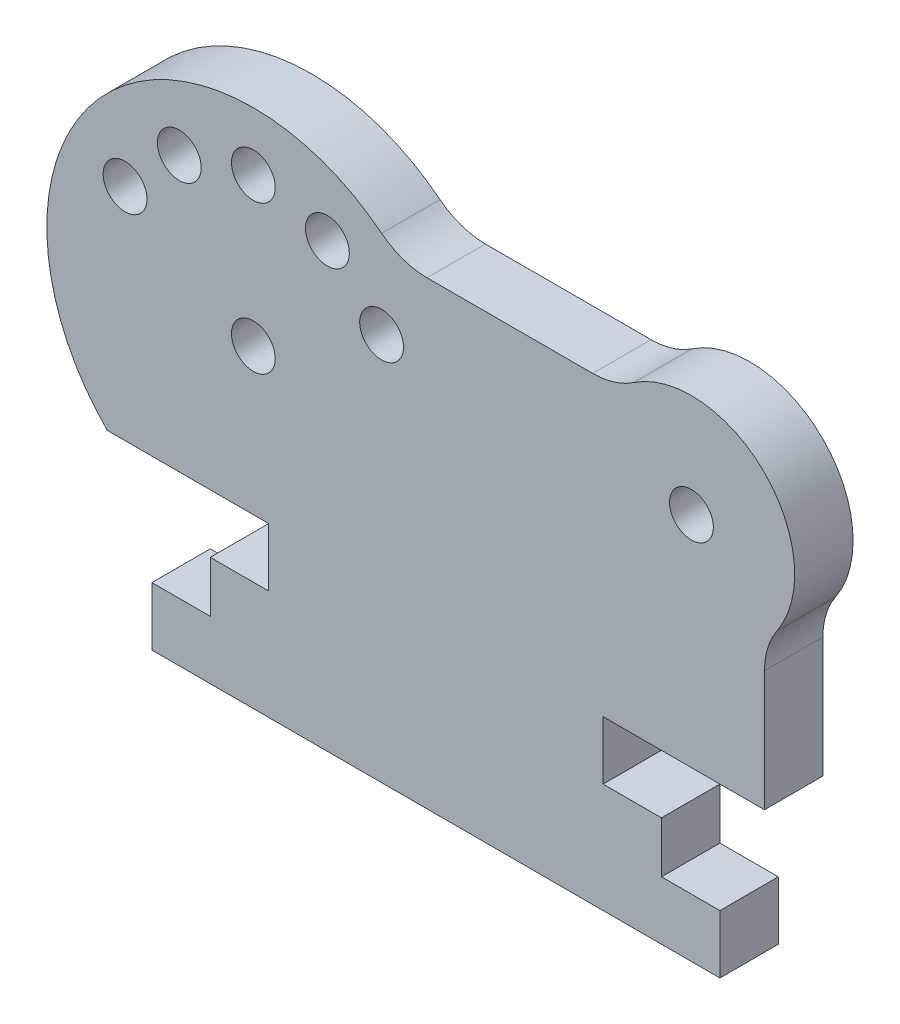
ISO-10303-21;
HEADER;
FILE_DESCRIPTION(('STEP AP214'),'2;1');
FILE_NAME('part.step','',(''),(''),'','','');
FILE_SCHEMA(('AUTOMOTIVE_DESIGN { 1 0 10303 214 1 1 1 1 }'));
ENDSEC;
DATA;
#1=APPLICATION_CONTEXT('core data for automotive mechanical design processes');
#2=APPLICATION_PROTOCOL_DEFINITION('international standard','automotive_design',2000,#1);
#3=PRODUCT_CONTEXT('',#1,'mechanical');
#4=PRODUCT('Part','Part','',(#3));
#5=PRODUCT_RELATED_PRODUCT_CATEGORY('part','',(#4));
#6=PRODUCT_DEFINITION_FORMATION('','',#4);
#7=PRODUCT_DEFINITION_CONTEXT('part definition',#1,'design');
#8=PRODUCT_DEFINITION('design','',#6,#7);
#9=PRODUCT_DEFINITION_SHAPE('','',#8);
#10=(LENGTH_UNIT() NAMED_UNIT(*) SI_UNIT(.MILLI.,.METRE.));
#11=(NAMED_UNIT(*) PLANE_ANGLE_UNIT() SI_UNIT($,.RADIAN.));
#12=(NAMED_UNIT(*) SI_UNIT($,.STERADIAN.) SOLID_ANGLE_UNIT());
#13=UNCERTAINTY_MEASURE_WITH_UNIT(LENGTH_MEASURE(1.E-05),#10,'distance_accuracy_value','');
#14=(GEOMETRIC_REPRESENTATION_CONTEXT(3) GLOBAL_UNCERTAINTY_ASSIGNED_CONTEXT((#13)) GLOBAL_UNIT_ASSIGNED_CONTEXT((#10,
#11,#12)) REPRESENTATION_CONTEXT('',''));
#15=CARTESIAN_POINT('',(0.,0.,0.));
#16=DIRECTION('',(0.,0.,1.));
#17=DIRECTION('',(1.,0.,0.));
#18=AXIS2_PLACEMENT_3D('',#15,#16,#17);
#19=CARTESIAN_POINT('',(36.95,26.5,4.));
#20=DIRECTION('',(0.,0.,-1.));
#21=DIRECTION('',(-1.,0.,0.));
#22=AXIS2_PLACEMENT_3D('',#19,#20,#21);
#23=CYLINDRICAL_SURFACE('',#22,1.5);
#24=CARTESIAN_POINT('',(36.95,26.5,4.));
#25=DIRECTION('',(0.,0.,1.));
#26=DIRECTION('',(1.,0.,0.));
#27=AXIS2_PLACEMENT_3D('',#24,#25,#26);
#28=CIRCLE('',#27,1.5);
#29=CARTESIAN_POINT('',(38.45,26.5,4.));
#30=VERTEX_POINT('',#29);
#31=EDGE_CURVE('E370',#30,#30,#28,.T.);
#32=ORIENTED_EDGE('',*,*,#31,.T.);
#33=EDGE_LOOP('',(#32));
#34=FACE_BOUND('',#33,.T.);
#35=CARTESIAN_POINT('',(36.95,26.5,0.));
#36=DIRECTION('',(0.,0.,1.));
#37=DIRECTION('',(1.,0.,0.));
#38=AXIS2_PLACEMENT_3D('',#35,#36,#37);
#39=CIRCLE('',#38,1.5);
#40=CARTESIAN_POINT('',(38.45,26.5,0.));
#41=VERTEX_POINT('',#40);
#42=EDGE_CURVE('E310',#41,#41,#39,.T.);
#43=ORIENTED_EDGE('',*,*,#42,.F.);
#44=EDGE_LOOP('',(#43));
#45=FACE_BOUND('',#44,.T.);
#46=ADVANCED_FACE('F151',(#34,#45),#23,.F.);
#47=CARTESIAN_POINT('',(1.87893218813431,30.283347098778,4.));
#48=DIRECTION('',(0.,0.,-1.));
#49=DIRECTION('',(-1.,0.,0.));
#50=AXIS2_PLACEMENT_3D('',#47,#48,#49);
#51=CYLINDRICAL_SURFACE('',#50,1.49999999999936);
#52=CARTESIAN_POINT('',(1.87893218813431,30.283347098778,4.));
#53=DIRECTION('',(0.,0.,1.));
#54=DIRECTION('',(1.,0.,0.));
#55=AXIS2_PLACEMENT_3D('',#52,#53,#54);
#56=CIRCLE('',#55,1.49999999999936);
#57=CARTESIAN_POINT('',(3.37893218813367,30.283347098778,4.));
#58=VERTEX_POINT('',#57);
#59=EDGE_CURVE('E367',#58,#58,#56,.T.);
#60=ORIENTED_EDGE('',*,*,#59,.T.);
#61=EDGE_LOOP('',(#60));
#62=FACE_BOUND('',#61,.T.);
#63=CARTESIAN_POINT('',(1.87893218813431,30.283347098778,0.));
#64=DIRECTION('',(0.,0.,1.));
#65=DIRECTION('',(1.,0.,0.));
#66=AXIS2_PLACEMENT_3D('',#63,#64,#65);
#67=CIRCLE('',#66,1.49999999999936);
#68=CARTESIAN_POINT('',(3.37893218813367,30.283347098778,0.));
#69=VERTEX_POINT('',#68);
#70=EDGE_CURVE('E433',#69,#69,#67,.T.);
#71=ORIENTED_EDGE('',*,*,#70,.F.);
#72=EDGE_LOOP('',(#71));
#73=FACE_BOUND('',#72,.T.);
#74=ADVANCED_FACE('F565',(#62,#73),#51,.F.);
#75=CARTESIAN_POINT('',(-1.83334709877815,26.5710678118655,4.));
#76=DIRECTION('',(0.,0.,-1.));
#77=DIRECTION('',(-1.,0.,0.));
#78=AXIS2_PLACEMENT_3D('',#75,#76,#77);
#79=CYLINDRICAL_SURFACE('',#78,1.49999999999932);
#80=CARTESIAN_POINT('',(-1.83334709877815,26.5710678118655,4.));
#81=DIRECTION('',(0.,0.,1.));
#82=DIRECTION('',(1.,0.,0.));
#83=AXIS2_PLACEMENT_3D('',#80,#81,#82);
#84=CIRCLE('',#83,1.49999999999932);
#85=CARTESIAN_POINT('',(-0.333347098778828,26.5710678118655,4.));
#86=VERTEX_POINT('',#85);
#87=EDGE_CURVE('E364',#86,#86,#84,.T.);
#88=ORIENTED_EDGE('',*,*,#87,.T.);
#89=EDGE_LOOP('',(#88));
#90=FACE_BOUND('',#89,.T.);
#91=CARTESIAN_POINT('',(-1.83334709877815,26.5710678118655,0.));
#92=DIRECTION('',(0.,0.,1.));
#93=DIRECTION('',(1.,0.,0.));
#94=AXIS2_PLACEMENT_3D('',#91,#92,#93);
#95=CIRCLE('',#94,1.49999999999932);
#96=CARTESIAN_POINT('',(-0.333347098778828,26.5710678118655,0.));
#97=VERTEX_POINT('',#96);
#98=EDGE_CURVE('E430',#97,#97,#95,.T.);
#99=ORIENTED_EDGE('',*,*,#98,.F.);
#100=EDGE_LOOP('',(#99));
#101=FACE_BOUND('',#100,.T.);
#102=ADVANCED_FACE('F571',(#90,#101),#79,.F.);
#103=CARTESIAN_POINT('',(6.95,31.642135623731,4.));
#104=DIRECTION('',(0.,0.,-1.));
#105=DIRECTION('',(-1.,0.,0.));
#106=AXIS2_PLACEMENT_3D('',#103,#104,#105);
#107=CYLINDRICAL_SURFACE('',#106,1.49999999999945);
#108=CARTESIAN_POINT('',(6.95,31.642135623731,4.));
#109=DIRECTION('',(0.,0.,1.));
#110=DIRECTION('',(1.,0.,0.));
#111=AXIS2_PLACEMENT_3D('',#108,#109,#110);
#112=CIRCLE('',#111,1.49999999999945);
#113=CARTESIAN_POINT('',(8.44999999999945,31.642135623731,4.));
#114=VERTEX_POINT('',#113);
#115=EDGE_CURVE('E361',#114,#114,#112,.T.);
#116=ORIENTED_EDGE('',*,*,#115,.T.);
#117=EDGE_LOOP('',(#116));
#118=FACE_BOUND('',#117,.T.);
#119=CARTESIAN_POINT('',(6.95,31.642135623731,0.));
#120=DIRECTION('',(0.,0.,1.));
#121=DIRECTION('',(1.,0.,0.));
#122=AXIS2_PLACEMENT_3D('',#119,#120,#121);
#123=CIRCLE('',#122,1.49999999999945);
#124=CARTESIAN_POINT('',(8.44999999999945,31.642135623731,0.));
#125=VERTEX_POINT('',#124);
#126=EDGE_CURVE('E427',#125,#125,#123,.T.);
#127=ORIENTED_EDGE('',*,*,#126,.F.);
#128=EDGE_LOOP('',(#127));
#129=FACE_BOUND('',#128,.T.);
#130=ADVANCED_FACE('F580',(#118,#129),#107,.F.);
#131=CARTESIAN_POINT('',(12.0210678118653,30.2833470987779,4.));
#132=DIRECTION('',(0.,0.,-1.));
#133=DIRECTION('',(-1.,0.,0.));
#134=AXIS2_PLACEMENT_3D('',#131,#132,#133);
#135=CYLINDRICAL_SURFACE('',#134,1.5);
#136=CARTESIAN_POINT('',(12.0210678118653,30.2833470987779,4.));
#137=DIRECTION('',(0.,0.,1.));
#138=DIRECTION('',(1.,0.,0.));
#139=AXIS2_PLACEMENT_3D('',#136,#137,#138);
#140=CIRCLE('',#139,1.5);
#141=CARTESIAN_POINT('',(13.5210678118653,30.2833470987779,4.));
#142=VERTEX_POINT('',#141);
#143=EDGE_CURVE('E358',#142,#142,#140,.T.);
#144=ORIENTED_EDGE('',*,*,#143,.T.);
#145=EDGE_LOOP('',(#144));
#146=FACE_BOUND('',#145,.T.);
#147=CARTESIAN_POINT('',(12.0210678118653,30.2833470987779,0.));
#148=DIRECTION('',(0.,0.,1.));
#149=DIRECTION('',(1.,0.,0.));
#150=AXIS2_PLACEMENT_3D('',#147,#148,#149);
#151=CIRCLE('',#150,1.5);
#152=CARTESIAN_POINT('',(13.5210678118653,30.2833470987779,0.));
#153=VERTEX_POINT('',#152);
#154=EDGE_CURVE('E424',#153,#153,#151,.T.);
#155=ORIENTED_EDGE('',*,*,#154,.F.);
#156=EDGE_LOOP('',(#155));
#157=FACE_BOUND('',#156,.T.);
#158=ADVANCED_FACE('F584',(#146,#157),#135,.F.);
#159=CARTESIAN_POINT('',(15.7333470987782,26.5710678118655,4.));
#160=DIRECTION('',(0.,0.,-1.));
#161=DIRECTION('',(-1.,0.,0.));
#162=AXIS2_PLACEMENT_3D('',#159,#160,#161);
#163=CYLINDRICAL_SURFACE('',#162,1.5);
#164=CARTESIAN_POINT('',(15.7333470987782,26.5710678118655,4.));
#165=DIRECTION('',(0.,0.,1.));
#166=DIRECTION('',(1.,0.,0.));
#167=AXIS2_PLACEMENT_3D('',#164,#165,#166);
#168=CIRCLE('',#167,1.5);
#169=CARTESIAN_POINT('',(17.2333470987782,26.5710678118655,4.));
#170=VERTEX_POINT('',#169);
#171=EDGE_CURVE('E355',#170,#170,#168,.T.);
#172=ORIENTED_EDGE('',*,*,#171,.T.);
#173=EDGE_LOOP('',(#172));
#174=FACE_BOUND('',#173,.T.);
#175=CARTESIAN_POINT('',(15.7333470987782,26.5710678118655,0.));
#176=DIRECTION('',(0.,0.,1.));
#177=DIRECTION('',(1.,0.,0.));
#178=AXIS2_PLACEMENT_3D('',#175,#176,#177);
#179=CIRCLE('',#178,1.5);
#180=CARTESIAN_POINT('',(17.2333470987782,26.5710678118655,0.));
#181=VERTEX_POINT('',#180);
#182=EDGE_CURVE('E421',#181,#181,#179,.T.);
#183=ORIENTED_EDGE('',*,*,#182,.F.);
#184=EDGE_LOOP('',(#183));
#185=FACE_BOUND('',#184,.T.);
#186=ADVANCED_FACE('F588',(#174,#185),#163,.F.);
#187=CARTESIAN_POINT('',(4.,0.,4.));
#188=DIRECTION('',(-1.,0.,0.));
#189=DIRECTION('',(0.,0.,1.));
#190=AXIS2_PLACEMENT_3D('',#187,#188,#189);
#191=PLANE('',#190);
#192=DIRECTION('',(0.,1.,0.));
#193=VECTOR('',#192,1.);
#194=CARTESIAN_POINT('',(4.,0.,0.));
#195=LINE('',#194,#193);
#196=CARTESIAN_POINT('',(4.,4.,0.));
#197=VERTEX_POINT('',#196);
#198=CARTESIAN_POINT('',(4.,7.5,0.));
#199=VERTEX_POINT('',#198);
#200=EDGE_CURVE('E375',#197,#199,#195,.T.);
#201=ORIENTED_EDGE('',*,*,#200,.F.);
#202=DIRECTION('',(0.,0.,-1.));
#203=VECTOR('',#202,1.);
#204=CARTESIAN_POINT('',(4.,4.,4.));
#205=LINE('',#204,#203);
#206=CARTESIAN_POINT('',(4.,4.,4.));
#207=VERTEX_POINT('',#206);
#208=EDGE_CURVE('E299',#207,#197,#205,.T.);
#209=ORIENTED_EDGE('',*,*,#208,.F.);
#210=DIRECTION('',(0.,1.,0.));
#211=VECTOR('',#210,1.);
#212=CARTESIAN_POINT('',(4.,0.,4.));
#213=LINE('',#212,#211);
#214=CARTESIAN_POINT('',(4.,7.5,4.));
#215=VERTEX_POINT('',#214);
#216=EDGE_CURVE('E305',#207,#215,#213,.T.);
#217=ORIENTED_EDGE('',*,*,#216,.T.);
#218=DIRECTION('',(0.,0.,-1.));
#219=VECTOR('',#218,1.);
#220=CARTESIAN_POINT('',(4.,7.5,4.));
#221=LINE('',#220,#219);
#222=EDGE_CURVE('E287',#215,#199,#221,.T.);
#223=ORIENTED_EDGE('',*,*,#222,.T.);
#224=EDGE_LOOP('',(#201,#209,#217,#223));
#225=FACE_BOUND('',#224,.T.);
#226=ADVANCED_FACE('F312',(#225),#191,.T.);
#227=CARTESIAN_POINT('',(0.,4.,4.));
#228=DIRECTION('',(0.,1.,0.));
#229=DIRECTION('',(0.,0.,1.));
#230=AXIS2_PLACEMENT_3D('',#227,#228,#229);
#231=PLANE('',#230);
#232=DIRECTION('',(1.,0.,0.));
#233=VECTOR('',#232,1.);
#234=CARTESIAN_POINT('',(0.,4.,0.));
#235=LINE('',#234,#233);
#236=CARTESIAN_POINT('',(0.,4.,0.));
#237=VERTEX_POINT('',#236);
#238=EDGE_CURVE('E378',#237,#197,#235,.T.);
#239=ORIENTED_EDGE('',*,*,#238,.F.);
#240=DIRECTION('',(0.,0.,-1.));
#241=VECTOR('',#240,1.);
#242=CARTESIAN_POINT('',(0.,4.,4.));
#243=LINE('',#242,#241);
#244=CARTESIAN_POINT('',(0.,4.,4.));
#245=VERTEX_POINT('',#244);
#246=EDGE_CURVE('E461',#245,#237,#243,.T.);
#247=ORIENTED_EDGE('',*,*,#246,.F.);
#248=DIRECTION('',(1.,0.,0.));
#249=VECTOR('',#248,1.);
#250=CARTESIAN_POINT('',(0.,4.,4.));
#251=LINE('',#250,#249);
#252=EDGE_CURVE('E313',#245,#207,#251,.T.);
#253=ORIENTED_EDGE('',*,*,#252,.T.);
#254=ORIENTED_EDGE('',*,*,#208,.T.);
#255=EDGE_LOOP('',(#239,#247,#253,#254));
#256=FACE_BOUND('',#255,.T.);
#257=ADVANCED_FACE('F508',(#256),#231,.T.);
#258=CARTESIAN_POINT('',(0.,0.,4.));
#259=DIRECTION('',(-1.,0.,0.));
#260=DIRECTION('',(0.,0.,1.));
#261=AXIS2_PLACEMENT_3D('',#258,#259,#260);
#262=PLANE('',#261);
#263=DIRECTION('',(0.,1.,0.));
#264=VECTOR('',#263,1.);
#265=CARTESIAN_POINT('',(0.,0.,0.));
#266=LINE('',#265,#264);
#267=CARTESIAN_POINT('',(0.,0.,0.));
#268=VERTEX_POINT('',#267);
#269=EDGE_CURVE('E381',#268,#237,#266,.T.);
#270=ORIENTED_EDGE('',*,*,#269,.F.);
#271=DIRECTION('',(0.,0.,-1.));
#272=VECTOR('',#271,1.);
#273=CARTESIAN_POINT('',(0.,0.,4.));
#274=LINE('',#273,#272);
#275=CARTESIAN_POINT('',(0.,0.,4.));
#276=VERTEX_POINT('',#275);
#277=EDGE_CURVE('E459',#276,#268,#274,.T.);
#278=ORIENTED_EDGE('',*,*,#277,.F.);
#279=DIRECTION('',(0.,1.,0.));
#280=VECTOR('',#279,1.);
#281=CARTESIAN_POINT('',(0.,0.,4.));
#282=LINE('',#281,#280);
#283=EDGE_CURVE('E315',#276,#245,#282,.T.);
#284=ORIENTED_EDGE('',*,*,#283,.T.);
#285=ORIENTED_EDGE('',*,*,#246,.T.);
#286=EDGE_LOOP('',(#270,#278,#284,#285));
#287=FACE_BOUND('',#286,.T.);
#288=ADVANCED_FACE('F512',(#287),#262,.T.);
#289=CARTESIAN_POINT('',(0.,0.,4.));
#290=DIRECTION('',(0.,-1.,0.));
#291=DIRECTION('',(0.,0.,-1.));
#292=AXIS2_PLACEMENT_3D('',#289,#290,#291);
#293=PLANE('',#292);
#294=DIRECTION('',(-1.,0.,0.));
#295=VECTOR('',#294,1.);
#296=CARTESIAN_POINT('',(0.,0.,0.));
#297=LINE('',#296,#295);
#298=CARTESIAN_POINT('',(38.9,0.,0.));
#299=VERTEX_POINT('',#298);
#300=EDGE_CURVE('E384',#299,#268,#297,.T.);
#301=ORIENTED_EDGE('',*,*,#300,.F.);
#302=DIRECTION('',(0.,0.,-1.));
#303=VECTOR('',#302,1.);
#304=CARTESIAN_POINT('',(38.9,0.,4.));
#305=LINE('',#304,#303);
#306=CARTESIAN_POINT('',(38.9,0.,4.));
#307=VERTEX_POINT('',#306);
#308=EDGE_CURVE('E457',#307,#299,#305,.T.);
#309=ORIENTED_EDGE('',*,*,#308,.F.);
#310=DIRECTION('',(-1.,0.,0.));
#311=VECTOR('',#310,1.);
#312=CARTESIAN_POINT('',(0.,0.,4.));
#313=LINE('',#312,#311);
#314=EDGE_CURVE('E320',#307,#276,#313,.T.);
#315=ORIENTED_EDGE('',*,*,#314,.T.);
#316=ORIENTED_EDGE('',*,*,#277,.T.);
#317=EDGE_LOOP('',(#301,#309,#315,#316));
#318=FACE_BOUND('',#317,.T.);
#319=ADVANCED_FACE('F515',(#318),#293,.T.);
#320=CARTESIAN_POINT('',(38.9,0.,4.));
#321=DIRECTION('',(1.,0.,0.));
#322=DIRECTION('',(0.,0.,-1.));
#323=AXIS2_PLACEMENT_3D('',#320,#321,#322);
#324=PLANE('',#323);
#325=DIRECTION('',(0.,-1.,0.));
#326=VECTOR('',#325,1.);
#327=CARTESIAN_POINT('',(38.9,0.,0.));
#328=LINE('',#327,#326);
#329=CARTESIAN_POINT('',(38.9,4.,0.));
#330=VERTEX_POINT('',#329);
#331=EDGE_CURVE('E387',#330,#299,#328,.T.);
#332=ORIENTED_EDGE('',*,*,#331,.F.);
#333=DIRECTION('',(0.,0.,-1.));
#334=VECTOR('',#333,1.);
#335=CARTESIAN_POINT('',(38.9,4.,4.));
#336=LINE('',#335,#334);
#337=CARTESIAN_POINT('',(38.9,4.,4.));
#338=VERTEX_POINT('',#337);
#339=EDGE_CURVE('E455',#338,#330,#336,.T.);
#340=ORIENTED_EDGE('',*,*,#339,.F.);
#341=DIRECTION('',(0.,-1.,0.));
#342=VECTOR('',#341,1.);
#343=CARTESIAN_POINT('',(38.9,0.,4.));
#344=LINE('',#343,#342);
#345=EDGE_CURVE('E323',#338,#307,#344,.T.);
#346=ORIENTED_EDGE('',*,*,#345,.T.);
#347=ORIENTED_EDGE('',*,*,#308,.T.);
#348=EDGE_LOOP('',(#332,#340,#346,#347));
#349=FACE_BOUND('',#348,.T.);
#350=ADVANCED_FACE('F520',(#349),#324,.T.);
#351=CARTESIAN_POINT('',(0.,4.,4.));
#352=DIRECTION('',(0.,1.,0.));
#353=DIRECTION('',(0.,0.,1.));
#354=AXIS2_PLACEMENT_3D('',#351,#352,#353);
#355=PLANE('',#354);
#356=DIRECTION('',(1.,0.,0.));
#357=VECTOR('',#356,1.);
#358=CARTESIAN_POINT('',(0.,4.,0.));
#359=LINE('',#358,#357);
#360=CARTESIAN_POINT('',(34.9,4.,0.));
#361=VERTEX_POINT('',#360);
#362=EDGE_CURVE('E390',#361,#330,#359,.T.);
#363=ORIENTED_EDGE('',*,*,#362,.F.);
#364=DIRECTION('',(0.,0.,-1.));
#365=VECTOR('',#364,1.);
#366=CARTESIAN_POINT('',(34.9,4.,4.));
#367=LINE('',#366,#365);
#368=CARTESIAN_POINT('',(34.9,4.,4.));
#369=VERTEX_POINT('',#368);
#370=EDGE_CURVE('E453',#369,#361,#367,.T.);
#371=ORIENTED_EDGE('',*,*,#370,.F.);
#372=DIRECTION('',(1.,0.,0.));
#373=VECTOR('',#372,1.);
#374=CARTESIAN_POINT('',(0.,4.,4.));
#375=LINE('',#374,#373);
#376=EDGE_CURVE('E326',#369,#338,#375,.T.);
#377=ORIENTED_EDGE('',*,*,#376,.T.);
#378=ORIENTED_EDGE('',*,*,#339,.T.);
#379=EDGE_LOOP('',(#363,#371,#377,#378));
#380=FACE_BOUND('',#379,.T.);
#381=ADVANCED_FACE('F523',(#380),#355,.T.);
#382=CARTESIAN_POINT('',(34.9,0.,4.));
#383=DIRECTION('',(1.,0.,0.));
#384=DIRECTION('',(0.,0.,-1.));
#385=AXIS2_PLACEMENT_3D('',#382,#383,#384);
#386=PLANE('',#385);
#387=DIRECTION('',(0.,-1.,0.));
#388=VECTOR('',#387,1.);
#389=CARTESIAN_POINT('',(34.9,0.,0.));
#390=LINE('',#389,#388);
#391=CARTESIAN_POINT('',(34.9,7.5,0.));
#392=VERTEX_POINT('',#391);
#393=EDGE_CURVE('E393',#392,#361,#390,.T.);
#394=ORIENTED_EDGE('',*,*,#393,.F.);
#395=DIRECTION('',(0.,0.,-1.));
#396=VECTOR('',#395,1.);
#397=CARTESIAN_POINT('',(34.9,7.5,4.));
#398=LINE('',#397,#396);
#399=CARTESIAN_POINT('',(34.9,7.5,4.));
#400=VERTEX_POINT('',#399);
#401=EDGE_CURVE('E451',#400,#392,#398,.T.);
#402=ORIENTED_EDGE('',*,*,#401,.F.);
#403=DIRECTION('',(0.,-1.,0.));
#404=VECTOR('',#403,1.);
#405=CARTESIAN_POINT('',(34.9,0.,4.));
#406=LINE('',#405,#404);
#407=EDGE_CURVE('E329',#400,#369,#406,.T.);
#408=ORIENTED_EDGE('',*,*,#407,.T.);
#409=ORIENTED_EDGE('',*,*,#370,.T.);
#410=EDGE_LOOP('',(#394,#402,#408,#409));
#411=FACE_BOUND('',#410,.T.);
#412=ADVANCED_FACE('F528',(#411),#386,.T.);
#413=CARTESIAN_POINT('',(0.,7.5,4.));
#414=DIRECTION('',(0.,1.,0.));
#415=DIRECTION('',(0.,0.,1.));
#416=AXIS2_PLACEMENT_3D('',#413,#414,#415);
#417=PLANE('',#416);
#418=DIRECTION('',(1.,0.,0.));
#419=VECTOR('',#418,1.);
#420=CARTESIAN_POINT('',(0.,7.5,0.));
#421=LINE('',#420,#419);
#422=CARTESIAN_POINT('',(30.9,7.5,0.));
#423=VERTEX_POINT('',#422);
#424=EDGE_CURVE('E396',#423,#392,#421,.T.);
#425=ORIENTED_EDGE('',*,*,#424,.F.);
#426=DIRECTION('',(0.,0.,-1.));
#427=VECTOR('',#426,1.);
#428=CARTESIAN_POINT('',(30.9,7.5,4.));
#429=LINE('',#428,#427);
#430=CARTESIAN_POINT('',(30.9,7.5,4.));
#431=VERTEX_POINT('',#430);
#432=EDGE_CURVE('E449',#431,#423,#429,.T.);
#433=ORIENTED_EDGE('',*,*,#432,.F.);
#434=DIRECTION('',(1.,0.,0.));
#435=VECTOR('',#434,1.);
#436=CARTESIAN_POINT('',(0.,7.5,4.));
#437=LINE('',#436,#435);
#438=EDGE_CURVE('E332',#431,#400,#437,.T.);
#439=ORIENTED_EDGE('',*,*,#438,.T.);
#440=ORIENTED_EDGE('',*,*,#401,.T.);
#441=EDGE_LOOP('',(#425,#433,#439,#440));
#442=FACE_BOUND('',#441,.T.);
#443=ADVANCED_FACE('F531',(#442),#417,.T.);
#444=CARTESIAN_POINT('',(30.9,0.,4.));
#445=DIRECTION('',(1.,0.,0.));
#446=DIRECTION('',(0.,0.,-1.));
#447=AXIS2_PLACEMENT_3D('',#444,#445,#446);
#448=PLANE('',#447);
#449=DIRECTION('',(0.,-1.,0.));
#450=VECTOR('',#449,1.);
#451=CARTESIAN_POINT('',(30.9,0.,0.));
#452=LINE('',#451,#450);
#453=CARTESIAN_POINT('',(30.9,11.5,0.));
#454=VERTEX_POINT('',#453);
#455=EDGE_CURVE('E399',#454,#423,#452,.T.);
#456=ORIENTED_EDGE('',*,*,#455,.F.);
#457=DIRECTION('',(0.,0.,-1.));
#458=VECTOR('',#457,1.);
#459=CARTESIAN_POINT('',(30.9,11.5,4.));
#460=LINE('',#459,#458);
#461=CARTESIAN_POINT('',(30.9,11.5,4.));
#462=VERTEX_POINT('',#461);
#463=EDGE_CURVE('E447',#462,#454,#460,.T.);
#464=ORIENTED_EDGE('',*,*,#463,.F.);
#465=DIRECTION('',(0.,-1.,0.));
#466=VECTOR('',#465,1.);
#467=CARTESIAN_POINT('',(30.9,0.,4.));
#468=LINE('',#467,#466);
#469=EDGE_CURVE('E335',#462,#431,#468,.T.);
#470=ORIENTED_EDGE('',*,*,#469,.T.);
#471=ORIENTED_EDGE('',*,*,#432,.T.);
#472=EDGE_LOOP('',(#456,#464,#470,#471));
#473=FACE_BOUND('',#472,.T.);
#474=ADVANCED_FACE('F536',(#473),#448,.T.);
#475=CARTESIAN_POINT('',(0.,11.5,4.));
#476=DIRECTION('',(0.,-1.,0.));
#477=DIRECTION('',(1.,0.,0.));
#478=AXIS2_PLACEMENT_3D('',#475,#476,#477);
#479=PLANE('',#478);
#480=DIRECTION('',(-1.,0.,0.));
#481=VECTOR('',#480,1.);
#482=CARTESIAN_POINT('',(0.,11.5,0.));
#483=LINE('',#482,#481);
#484=CARTESIAN_POINT('',(41.95,11.5,0.));
#485=VERTEX_POINT('',#484);
#486=EDGE_CURVE('E402',#485,#454,#483,.T.);
#487=ORIENTED_EDGE('',*,*,#486,.F.);
#488=DIRECTION('',(0.,0.,-1.));
#489=VECTOR('',#488,1.);
#490=CARTESIAN_POINT('',(41.95,11.5,4.));
#491=LINE('',#490,#489);
#492=CARTESIAN_POINT('',(41.95,11.5,4.));
#493=VERTEX_POINT('',#492);
#494=EDGE_CURVE('E444',#493,#485,#491,.T.);
#495=ORIENTED_EDGE('',*,*,#494,.F.);
#496=DIRECTION('',(-1.,0.,0.));
#497=VECTOR('',#496,1.);
#498=CARTESIAN_POINT('',(0.,11.5,4.));
#499=LINE('',#498,#497);
#500=EDGE_CURVE('E338',#493,#462,#499,.T.);
#501=ORIENTED_EDGE('',*,*,#500,.T.);
#502=ORIENTED_EDGE('',*,*,#463,.T.);
#503=EDGE_LOOP('',(#487,#495,#501,#502));
#504=FACE_BOUND('',#503,.T.);
#505=ADVANCED_FACE('F539',(#504),#479,.T.);
#506=CARTESIAN_POINT('',(41.95,0.,4.));
#507=DIRECTION('',(1.,0.,0.));
#508=DIRECTION('',(0.,1.,0.));
#509=AXIS2_PLACEMENT_3D('',#506,#507,#508);
#510=PLANE('',#509);
#511=DIRECTION('',(0.,-1.,0.));
#512=VECTOR('',#511,1.);
#513=CARTESIAN_POINT('',(41.95,0.,0.));
#514=LINE('',#513,#512);
#515=CARTESIAN_POINT('',(41.95,19.7390327527302,0.));
#516=VERTEX_POINT('',#515);
#517=EDGE_CURVE('E405',#516,#485,#514,.T.);
#518=ORIENTED_EDGE('',*,*,#517,.F.);
#519=DIRECTION('',(0.,0.,-1.));
#520=VECTOR('',#519,1.);
#521=CARTESIAN_POINT('',(41.95,19.7390327527302,4.));
#522=LINE('',#521,#520);
#523=CARTESIAN_POINT('',(41.95,19.7390327527302,4.));
#524=VERTEX_POINT('',#523);
#525=EDGE_CURVE('E473',#516,#524,#522,.F.);
#526=ORIENTED_EDGE('',*,*,#525,.T.);
#527=DIRECTION('',(0.,-1.,0.));
#528=VECTOR('',#527,1.);
#529=CARTESIAN_POINT('',(41.95,0.,4.));
#530=LINE('',#529,#528);
#531=EDGE_CURVE('E341',#524,#493,#530,.T.);
#532=ORIENTED_EDGE('',*,*,#531,.T.);
#533=ORIENTED_EDGE('',*,*,#494,.T.);
#534=EDGE_LOOP('',(#518,#526,#532,#533));
#535=FACE_BOUND('',#534,.T.);
#536=ADVANCED_FACE('F604',(#535),#510,.T.);
#537=CARTESIAN_POINT('',(36.95,26.5,4.));
#538=DIRECTION('',(0.,0.,-1.));
#539=DIRECTION('',(-1.,0.,0.));
#540=AXIS2_PLACEMENT_3D('',#537,#538,#539);
#541=CYLINDRICAL_SURFACE('',#540,7.07106781186547);
#542=CARTESIAN_POINT('',(36.95,26.5,4.));
#543=DIRECTION('',(0.,0.,1.));
#544=DIRECTION('',(1.,0.,0.));
#545=AXIS2_PLACEMENT_3D('',#542,#543,#544);
#546=CIRCLE('',#545,7.07106781186547);
#547=CARTESIAN_POINT('',(42.8078643762691,22.5395170813097,4.));
#548=VERTEX_POINT('',#547);
#549=CARTESIAN_POINT('',(32.9895170813097,32.357864376269,4.));
#550=VERTEX_POINT('',#549);
#551=EDGE_CURVE('E343',#548,#550,#546,.T.);
#552=ORIENTED_EDGE('',*,*,#551,.F.);
#553=DIRECTION('',(0.,0.,-1.));
#554=VECTOR('',#553,1.);
#555=CARTESIAN_POINT('',(42.8078643762691,22.5395170813097,4.));
#556=LINE('',#555,#554);
#557=CARTESIAN_POINT('',(42.8078643762691,22.5395170813097,0.));
#558=VERTEX_POINT('',#557);
#559=EDGE_CURVE('E470',#548,#558,#556,.T.);
#560=ORIENTED_EDGE('',*,*,#559,.T.);
#561=CARTESIAN_POINT('',(36.95,26.5,0.));
#562=DIRECTION('',(0.,0.,1.));
#563=DIRECTION('',(1.,0.,0.));
#564=AXIS2_PLACEMENT_3D('',#561,#562,#563);
#565=CIRCLE('',#564,7.07106781186547);
#566=CARTESIAN_POINT('',(32.9895170813097,32.357864376269,0.));
#567=VERTEX_POINT('',#566);
#568=EDGE_CURVE('E407',#558,#567,#565,.T.);
#569=ORIENTED_EDGE('',*,*,#568,.T.);
#570=DIRECTION('',(0.,0.,-1.));
#571=VECTOR('',#570,1.);
#572=CARTESIAN_POINT('',(32.9895170813097,32.357864376269,4.));
#573=LINE('',#572,#571);
#574=EDGE_CURVE('E298',#567,#550,#573,.F.);
#575=ORIENTED_EDGE('',*,*,#574,.T.);
#576=EDGE_LOOP('',(#552,#560,#569,#575));
#577=FACE_BOUND('',#576,.T.);
#578=ADVANCED_FACE('F551',(#577),#541,.T.);
#579=CARTESIAN_POINT('',(0.,31.5,4.));
#580=DIRECTION('',(0.,1.,0.));
#581=DIRECTION('',(0.,0.,1.));
#582=AXIS2_PLACEMENT_3D('',#579,#580,#581);
#583=PLANE('',#582);
#584=DIRECTION('',(1.,0.,0.));
#585=VECTOR('',#584,1.);
#586=CARTESIAN_POINT('',(0.,31.5,4.));
#587=LINE('',#586,#585);
#588=CARTESIAN_POINT('',(18.8420711500272,31.5,4.));
#589=VERTEX_POINT('',#588);
#590=CARTESIAN_POINT('',(30.1890327527302,31.5,4.));
#591=VERTEX_POINT('',#590);
#592=EDGE_CURVE('E346',#589,#591,#587,.T.);
#593=ORIENTED_EDGE('',*,*,#592,.T.);
#594=DIRECTION('',(0.,0.,-1.));
#595=VECTOR('',#594,1.);
#596=CARTESIAN_POINT('',(30.1890327527302,31.5,4.));
#597=LINE('',#596,#595);
#598=CARTESIAN_POINT('',(30.1890327527302,31.5,0.));
#599=VERTEX_POINT('',#598);
#600=EDGE_CURVE('E477',#591,#599,#597,.T.);
#601=ORIENTED_EDGE('',*,*,#600,.T.);
#602=DIRECTION('',(1.,0.,0.));
#603=VECTOR('',#602,1.);
#604=CARTESIAN_POINT('',(0.,31.5,0.));
#605=LINE('',#604,#603);
#606=CARTESIAN_POINT('',(18.8420711500272,31.5,0.));
#607=VERTEX_POINT('',#606);
#608=EDGE_CURVE('E410',#607,#599,#605,.T.);
#609=ORIENTED_EDGE('',*,*,#608,.F.);
#610=DIRECTION('',(0.,0.,-1.));
#611=VECTOR('',#610,1.);
#612=CARTESIAN_POINT('',(18.8420711500272,31.5,4.));
#613=LINE('',#612,#611);
#614=EDGE_CURVE('E475',#607,#589,#613,.F.);
#615=ORIENTED_EDGE('',*,*,#614,.T.);
#616=EDGE_LOOP('',(#593,#601,#609,#615));
#617=FACE_BOUND('',#616,.T.);
#618=ADVANCED_FACE('F495',(#617),#583,.T.);
#619=CARTESIAN_POINT('',(6.95000000000001,21.5,4.));
#620=DIRECTION('',(0.,0.,-1.));
#621=DIRECTION('',(-1.,0.,0.));
#622=AXIS2_PLACEMENT_3D('',#619,#620,#621);
#623=CYLINDRICAL_SURFACE('',#622,14.1421356237309);
#624=CARTESIAN_POINT('',(6.95000000000001,21.5,4.));
#625=DIRECTION('',(0.,0.,1.));
#626=DIRECTION('',(1.,0.,0.));
#627=AXIS2_PLACEMENT_3D('',#624,#625,#626);
#628=CIRCLE('',#627,14.1421356237309);
#629=CARTESIAN_POINT('',(15.7358160842956,32.5819418755439,4.));
#630=VERTEX_POINT('',#629);
#631=CARTESIAN_POINT('',(-3.04999999999999,11.5,4.));
#632=VERTEX_POINT('',#631);
#633=EDGE_CURVE('E349',#630,#632,#628,.T.);
#634=ORIENTED_EDGE('',*,*,#633,.F.);
#635=DIRECTION('',(0.,0.,-1.));
#636=VECTOR('',#635,1.);
#637=CARTESIAN_POINT('',(15.7358160842956,32.5819418755439,4.));
#638=LINE('',#637,#636);
#639=CARTESIAN_POINT('',(15.7358160842956,32.5819418755439,0.));
#640=VERTEX_POINT('',#639);
#641=EDGE_CURVE('E480',#630,#640,#638,.T.);
#642=ORIENTED_EDGE('',*,*,#641,.T.);
#643=CARTESIAN_POINT('',(6.95000000000001,21.5,0.));
#644=DIRECTION('',(0.,0.,1.));
#645=DIRECTION('',(1.,0.,0.));
#646=AXIS2_PLACEMENT_3D('',#643,#644,#645);
#647=CIRCLE('',#646,14.1421356237309);
#648=CARTESIAN_POINT('',(-3.04999999999999,11.5,0.));
#649=VERTEX_POINT('',#648);
#650=EDGE_CURVE('E413',#640,#649,#647,.T.);
#651=ORIENTED_EDGE('',*,*,#650,.T.);
#652=DIRECTION('',(0.,0.,-1.));
#653=VECTOR('',#652,1.);
#654=CARTESIAN_POINT('',(-3.04999999999999,11.5,4.));
#655=LINE('',#654,#653);
#656=EDGE_CURVE('E441',#632,#649,#655,.T.);
#657=ORIENTED_EDGE('',*,*,#656,.F.);
#658=EDGE_LOOP('',(#634,#642,#651,#657));
#659=FACE_BOUND('',#658,.T.);
#660=ADVANCED_FACE('F498',(#659),#623,.T.);
#661=CARTESIAN_POINT('',(0.,11.5,4.));
#662=DIRECTION('',(0.,-1.,0.));
#663=DIRECTION('',(1.,0.,0.));
#664=AXIS2_PLACEMENT_3D('',#661,#662,#663);
#665=PLANE('',#664);
#666=DIRECTION('',(-1.,0.,0.));
#667=VECTOR('',#666,1.);
#668=CARTESIAN_POINT('',(0.,11.5,0.));
#669=LINE('',#668,#667);
#670=CARTESIAN_POINT('',(8.,11.5,0.));
#671=VERTEX_POINT('',#670);
#672=EDGE_CURVE('E415',#671,#649,#669,.T.);
#673=ORIENTED_EDGE('',*,*,#672,.F.);
#674=DIRECTION('',(0.,0.,-1.));
#675=VECTOR('',#674,1.);
#676=CARTESIAN_POINT('',(8.,11.5,4.));
#677=LINE('',#676,#675);
#678=CARTESIAN_POINT('',(8.,11.5,4.));
#679=VERTEX_POINT('',#678);
#680=EDGE_CURVE('E439',#679,#671,#677,.T.);
#681=ORIENTED_EDGE('',*,*,#680,.F.);
#682=DIRECTION('',(-1.,0.,0.));
#683=VECTOR('',#682,1.);
#684=CARTESIAN_POINT('',(0.,11.5,4.));
#685=LINE('',#684,#683);
#686=EDGE_CURVE('E351',#679,#632,#685,.T.);
#687=ORIENTED_EDGE('',*,*,#686,.T.);
#688=ORIENTED_EDGE('',*,*,#656,.T.);
#689=EDGE_LOOP('',(#673,#681,#687,#688));
#690=FACE_BOUND('',#689,.T.);
#691=ADVANCED_FACE('F595',(#690),#665,.T.);
#692=CARTESIAN_POINT('',(8.,0.,4.));
#693=DIRECTION('',(-1.,0.,0.));
#694=DIRECTION('',(0.,0.,1.));
#695=AXIS2_PLACEMENT_3D('',#692,#693,#694);
#696=PLANE('',#695);
#697=DIRECTION('',(0.,1.,0.));
#698=VECTOR('',#697,1.);
#699=CARTESIAN_POINT('',(8.,0.,0.));
#700=LINE('',#699,#698);
#701=CARTESIAN_POINT('',(8.,7.5,0.));
#702=VERTEX_POINT('',#701);
#703=EDGE_CURVE('E418',#702,#671,#700,.T.);
#704=ORIENTED_EDGE('',*,*,#703,.F.);
#705=DIRECTION('',(0.,0.,-1.));
#706=VECTOR('',#705,1.);
#707=CARTESIAN_POINT('',(8.,7.5,4.));
#708=LINE('',#707,#706);
#709=CARTESIAN_POINT('',(8.,7.5,4.));
#710=VERTEX_POINT('',#709);
#711=EDGE_CURVE('E373',#710,#702,#708,.T.);
#712=ORIENTED_EDGE('',*,*,#711,.F.);
#713=DIRECTION('',(0.,1.,0.));
#714=VECTOR('',#713,1.);
#715=CARTESIAN_POINT('',(8.,0.,4.));
#716=LINE('',#715,#714);
#717=EDGE_CURVE('E309',#710,#679,#716,.T.);
#718=ORIENTED_EDGE('',*,*,#717,.T.);
#719=ORIENTED_EDGE('',*,*,#680,.T.);
#720=EDGE_LOOP('',(#704,#712,#718,#719));
#721=FACE_BOUND('',#720,.T.);
#722=ADVANCED_FACE('F503',(#721),#696,.T.);
#723=CARTESIAN_POINT('',(0.,7.5,4.));
#724=DIRECTION('',(0.,1.,0.));
#725=DIRECTION('',(0.,0.,1.));
#726=AXIS2_PLACEMENT_3D('',#723,#724,#725);
#727=PLANE('',#726);
#728=DIRECTION('',(1.,0.,0.));
#729=VECTOR('',#728,1.);
#730=CARTESIAN_POINT('',(0.,7.5,0.));
#731=LINE('',#730,#729);
#732=EDGE_CURVE('E293',#199,#702,#731,.T.);
#733=ORIENTED_EDGE('',*,*,#732,.F.);
#734=ORIENTED_EDGE('',*,*,#222,.F.);
#735=DIRECTION('',(1.,0.,0.));
#736=VECTOR('',#735,1.);
#737=CARTESIAN_POINT('',(0.,7.5,4.));
#738=LINE('',#737,#736);
#739=EDGE_CURVE('E290',#215,#710,#738,.T.);
#740=ORIENTED_EDGE('',*,*,#739,.T.);
#741=ORIENTED_EDGE('',*,*,#711,.T.);
#742=EDGE_LOOP('',(#733,#734,#740,#741));
#743=FACE_BOUND('',#742,.T.);
#744=ADVANCED_FACE('F289',(#743),#727,.T.);
#745=CARTESIAN_POINT('',(0.,0.,0.));
#746=DIRECTION('',(0.,0.,1.));
#747=DIRECTION('',(1.,0.,0.));
#748=AXIS2_PLACEMENT_3D('',#745,#746,#747);
#749=PLANE('',#748);
#750=ORIENTED_EDGE('',*,*,#732,.T.);
#751=ORIENTED_EDGE('',*,*,#703,.T.);
#752=ORIENTED_EDGE('',*,*,#672,.T.);
#753=ORIENTED_EDGE('',*,*,#650,.F.);
#754=CARTESIAN_POINT('',(18.8420711500272,36.5,0.));
#755=DIRECTION('',(0.,0.,1.));
#756=DIRECTION('',(1.,0.,0.));
#757=AXIS2_PLACEMENT_3D('',#754,#755,#756);
#758=CIRCLE('',#757,5.);
#759=EDGE_CURVE('E159',#640,#607,#758,.T.);
#760=ORIENTED_EDGE('',*,*,#759,.T.);
#761=ORIENTED_EDGE('',*,*,#608,.T.);
#762=CARTESIAN_POINT('',(30.1890327527302,36.5,0.));
#763=DIRECTION('',(0.,0.,1.));
#764=DIRECTION('',(1.,0.,0.));
#765=AXIS2_PLACEMENT_3D('',#762,#763,#764);
#766=CIRCLE('',#765,5.);
#767=EDGE_CURVE('E486',#599,#567,#766,.T.);
#768=ORIENTED_EDGE('',*,*,#767,.T.);
#769=ORIENTED_EDGE('',*,*,#568,.F.);
#770=CARTESIAN_POINT('',(46.95,19.7390327527302,0.));
#771=DIRECTION('',(0.,0.,1.));
#772=DIRECTION('',(1.,0.,0.));
#773=AXIS2_PLACEMENT_3D('',#770,#771,#772);
#774=CIRCLE('',#773,5.);
#775=EDGE_CURVE('E482',#558,#516,#774,.T.);
#776=ORIENTED_EDGE('',*,*,#775,.T.);
#777=ORIENTED_EDGE('',*,*,#517,.T.);
#778=ORIENTED_EDGE('',*,*,#486,.T.);
#779=ORIENTED_EDGE('',*,*,#455,.T.);
#780=ORIENTED_EDGE('',*,*,#424,.T.);
#781=ORIENTED_EDGE('',*,*,#393,.T.);
#782=ORIENTED_EDGE('',*,*,#362,.T.);
#783=ORIENTED_EDGE('',*,*,#331,.T.);
#784=ORIENTED_EDGE('',*,*,#300,.T.);
#785=ORIENTED_EDGE('',*,*,#269,.T.);
#786=ORIENTED_EDGE('',*,*,#238,.T.);
#787=ORIENTED_EDGE('',*,*,#200,.T.);
#788=EDGE_LOOP('',(#750,#751,#752,#753,#760,#761,#768,#769,#776,#777,#778,#779,#780,#781,#782,
#783,#784,#785,#786,#787));
#789=FACE_BOUND('',#788,.T.);
#790=ORIENTED_EDGE('',*,*,#182,.T.);
#791=EDGE_LOOP('',(#790));
#792=FACE_BOUND('',#791,.T.);
#793=ORIENTED_EDGE('',*,*,#154,.T.);
#794=EDGE_LOOP('',(#793));
#795=FACE_BOUND('',#794,.T.);
#796=ORIENTED_EDGE('',*,*,#126,.T.);
#797=EDGE_LOOP('',(#796));
#798=FACE_BOUND('',#797,.T.);
#799=ORIENTED_EDGE('',*,*,#98,.T.);
#800=EDGE_LOOP('',(#799));
#801=FACE_BOUND('',#800,.T.);
#802=ORIENTED_EDGE('',*,*,#70,.T.);
#803=EDGE_LOOP('',(#802));
#804=FACE_BOUND('',#803,.T.);
#805=ORIENTED_EDGE('',*,*,#42,.T.);
#806=EDGE_LOOP('',(#805));
#807=FACE_BOUND('',#806,.T.);
#808=CARTESIAN_POINT('',(6.95000000000001,21.5,0.));
#809=DIRECTION('',(0.,0.,1.));
#810=DIRECTION('',(1.,0.,0.));
#811=AXIS2_PLACEMENT_3D('',#808,#809,#810);
#812=CIRCLE('',#811,1.5);
#813=CARTESIAN_POINT('',(8.45000000000001,21.5,0.));
#814=VERTEX_POINT('',#813);
#815=EDGE_CURVE('E466',#814,#814,#812,.T.);
#816=ORIENTED_EDGE('',*,*,#815,.T.);
#817=EDGE_LOOP('',(#816));
#818=FACE_BOUND('',#817,.T.);
#819=ADVANCED_FACE('F492',(#789,#792,#795,#798,#801,#804,#807,#818),#749,.F.);
#820=CARTESIAN_POINT('',(0.,0.,4.));
#821=DIRECTION('',(0.,0.,1.));
#822=DIRECTION('',(1.,0.,0.));
#823=AXIS2_PLACEMENT_3D('',#820,#821,#822);
#824=PLANE('',#823);
#825=ORIENTED_EDGE('',*,*,#739,.F.);
#826=ORIENTED_EDGE('',*,*,#216,.F.);
#827=ORIENTED_EDGE('',*,*,#252,.F.);
#828=ORIENTED_EDGE('',*,*,#283,.F.);
#829=ORIENTED_EDGE('',*,*,#314,.F.);
#830=ORIENTED_EDGE('',*,*,#345,.F.);
#831=ORIENTED_EDGE('',*,*,#376,.F.);
#832=ORIENTED_EDGE('',*,*,#407,.F.);
#833=ORIENTED_EDGE('',*,*,#438,.F.);
#834=ORIENTED_EDGE('',*,*,#469,.F.);
#835=ORIENTED_EDGE('',*,*,#500,.F.);
#836=ORIENTED_EDGE('',*,*,#531,.F.);
#837=CARTESIAN_POINT('',(46.95,19.7390327527302,4.));
#838=DIRECTION('',(0.,0.,1.));
#839=DIRECTION('',(1.,0.,0.));
#840=AXIS2_PLACEMENT_3D('',#837,#838,#839);
#841=CIRCLE('',#840,5.);
#842=EDGE_CURVE('E484',#524,#548,#841,.F.);
#843=ORIENTED_EDGE('',*,*,#842,.T.);
#844=ORIENTED_EDGE('',*,*,#551,.T.);
#845=CARTESIAN_POINT('',(30.1890327527302,36.5,4.));
#846=DIRECTION('',(0.,0.,1.));
#847=DIRECTION('',(1.,0.,0.));
#848=AXIS2_PLACEMENT_3D('',#845,#846,#847);
#849=CIRCLE('',#848,5.);
#850=EDGE_CURVE('E488',#550,#591,#849,.F.);
#851=ORIENTED_EDGE('',*,*,#850,.T.);
#852=ORIENTED_EDGE('',*,*,#592,.F.);
#853=CARTESIAN_POINT('',(18.8420711500272,36.5,4.));
#854=DIRECTION('',(0.,0.,1.));
#855=DIRECTION('',(1.,0.,0.));
#856=AXIS2_PLACEMENT_3D('',#853,#854,#855);
#857=CIRCLE('',#856,5.);
#858=EDGE_CURVE('E12',#589,#630,#857,.F.);
#859=ORIENTED_EDGE('',*,*,#858,.T.);
#860=ORIENTED_EDGE('',*,*,#633,.T.);
#861=ORIENTED_EDGE('',*,*,#686,.F.);
#862=ORIENTED_EDGE('',*,*,#717,.F.);
#863=EDGE_LOOP('',(#825,#826,#827,#828,#829,#830,#831,#832,#833,#834,#835,#836,#843,#844,#851,
#852,#859,#860,#861,#862));
#864=FACE_BOUND('',#863,.T.);
#865=ORIENTED_EDGE('',*,*,#171,.F.);
#866=EDGE_LOOP('',(#865));
#867=FACE_BOUND('',#866,.T.);
#868=ORIENTED_EDGE('',*,*,#143,.F.);
#869=EDGE_LOOP('',(#868));
#870=FACE_BOUND('',#869,.T.);
#871=ORIENTED_EDGE('',*,*,#115,.F.);
#872=EDGE_LOOP('',(#871));
#873=FACE_BOUND('',#872,.T.);
#874=ORIENTED_EDGE('',*,*,#87,.F.);
#875=EDGE_LOOP('',(#874));
#876=FACE_BOUND('',#875,.T.);
#877=ORIENTED_EDGE('',*,*,#59,.F.);
#878=EDGE_LOOP('',(#877));
#879=FACE_BOUND('',#878,.T.);
#880=ORIENTED_EDGE('',*,*,#31,.F.);
#881=EDGE_LOOP('',(#880));
#882=FACE_BOUND('',#881,.T.);
#883=CARTESIAN_POINT('',(6.95000000000001,21.5,4.));
#884=DIRECTION('',(0.,0.,1.));
#885=DIRECTION('',(1.,0.,0.));
#886=AXIS2_PLACEMENT_3D('',#883,#884,#885);
#887=CIRCLE('',#886,1.5);
#888=CARTESIAN_POINT('',(8.45000000000001,21.5,4.));
#889=VERTEX_POINT('',#888);
#890=EDGE_CURVE('E376',#889,#889,#887,.T.);
#891=ORIENTED_EDGE('',*,*,#890,.F.);
#892=EDGE_LOOP('',(#891));
#893=FACE_BOUND('',#892,.T.);
#894=ADVANCED_FACE('F302',(#864,#867,#870,#873,#876,#879,#882,#893),#824,.T.);
#895=CARTESIAN_POINT('',(6.95000000000001,21.5,4.));
#896=DIRECTION('',(0.,0.,-1.));
#897=DIRECTION('',(-1.,0.,0.));
#898=AXIS2_PLACEMENT_3D('',#895,#896,#897);
#899=CYLINDRICAL_SURFACE('',#898,1.5);
#900=ORIENTED_EDGE('',*,*,#890,.T.);
#901=EDGE_LOOP('',(#900));
#902=FACE_BOUND('',#901,.T.);
#903=ORIENTED_EDGE('',*,*,#815,.F.);
#904=EDGE_LOOP('',(#903));
#905=FACE_BOUND('',#904,.T.);
#906=ADVANCED_FACE('F562',(#902,#905),#899,.F.);
#907=CARTESIAN_POINT('',(46.95,19.7390327527302,4.));
#908=DIRECTION('',(0.,0.,-1.));
#909=DIRECTION('',(-1.,0.,0.));
#910=AXIS2_PLACEMENT_3D('',#907,#908,#909);
#911=CYLINDRICAL_SURFACE('',#910,5.);
#912=ORIENTED_EDGE('',*,*,#842,.F.);
#913=ORIENTED_EDGE('',*,*,#525,.F.);
#914=ORIENTED_EDGE('',*,*,#775,.F.);
#915=ORIENTED_EDGE('',*,*,#559,.F.);
#916=EDGE_LOOP('',(#912,#913,#914,#915));
#917=FACE_BOUND('',#916,.T.);
#918=ADVANCED_FACE('F548',(#917),#911,.F.);
#919=CARTESIAN_POINT('',(30.1890327527302,36.5,4.));
#920=DIRECTION('',(0.,0.,-1.));
#921=DIRECTION('',(-1.,0.,0.));
#922=AXIS2_PLACEMENT_3D('',#919,#920,#921);
#923=CYLINDRICAL_SURFACE('',#922,5.);
#924=ORIENTED_EDGE('',*,*,#850,.F.);
#925=ORIENTED_EDGE('',*,*,#574,.F.);
#926=ORIENTED_EDGE('',*,*,#767,.F.);
#927=ORIENTED_EDGE('',*,*,#600,.F.);
#928=EDGE_LOOP('',(#924,#925,#926,#927));
#929=FACE_BOUND('',#928,.T.);
#930=ADVANCED_FACE('F556',(#929),#923,.F.);
#931=CARTESIAN_POINT('',(18.8420711500272,36.5,4.));
#932=DIRECTION('',(0.,0.,-1.));
#933=DIRECTION('',(-1.,0.,0.));
#934=AXIS2_PLACEMENT_3D('',#931,#932,#933);
#935=CYLINDRICAL_SURFACE('',#934,5.);
#936=ORIENTED_EDGE('',*,*,#858,.F.);
#937=ORIENTED_EDGE('',*,*,#614,.F.);
#938=ORIENTED_EDGE('',*,*,#759,.F.);
#939=ORIENTED_EDGE('',*,*,#641,.F.);
#940=EDGE_LOOP('',(#936,#937,#938,#939));
#941=FACE_BOUND('',#940,.T.);
#942=ADVANCED_FACE('F153',(#941),#935,.F.);
#943=CLOSED_SHELL('',(#46,#74,#102,#130,#158,#186,#226,#257,#288,#319,#350,#381,#412,#443,#474,
#505,#536,#578,#618,#660,#691,#722,#744,#819,#894,#906,#918,#930,#942));
#944=MANIFOLD_SOLID_BREP('B2',#943);
#945=ADVANCED_BREP_SHAPE_REPRESENTATION('',(#18,#944),#14);
#946=SHAPE_DEFINITION_REPRESENTATION(#9,#945);
ENDSEC;
END-ISO-10303-21;
